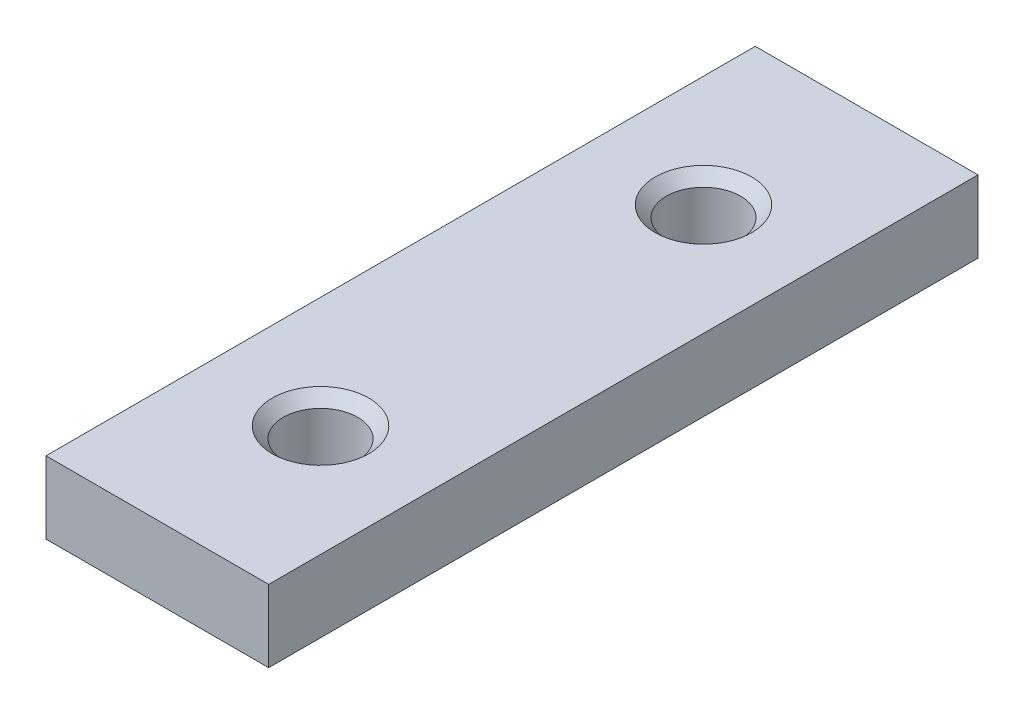
ISO-10303-21;
HEADER;
FILE_DESCRIPTION(('STEP AP214'),'2;1');
FILE_NAME('part.step','',(''),(''),'','','');
FILE_SCHEMA(('AUTOMOTIVE_DESIGN { 1 0 10303 214 1 1 1 1 }'));
ENDSEC;
DATA;
#1=APPLICATION_CONTEXT('core data for automotive mechanical design processes');
#2=APPLICATION_PROTOCOL_DEFINITION('international standard','automotive_design',2000,#1);
#3=PRODUCT_CONTEXT('',#1,'mechanical');
#4=PRODUCT('Part','Part','',(#3));
#5=PRODUCT_RELATED_PRODUCT_CATEGORY('part','',(#4));
#6=PRODUCT_DEFINITION_FORMATION('','',#4);
#7=PRODUCT_DEFINITION_CONTEXT('part definition',#1,'design');
#8=PRODUCT_DEFINITION('design','',#6,#7);
#9=PRODUCT_DEFINITION_SHAPE('','',#8);
#10=(LENGTH_UNIT() NAMED_UNIT(*) SI_UNIT(.MILLI.,.METRE.));
#11=(NAMED_UNIT(*) PLANE_ANGLE_UNIT() SI_UNIT($,.RADIAN.));
#12=(NAMED_UNIT(*) SI_UNIT($,.STERADIAN.) SOLID_ANGLE_UNIT());
#13=UNCERTAINTY_MEASURE_WITH_UNIT(LENGTH_MEASURE(1.E-05),#10,'distance_accuracy_value','');
#14=(GEOMETRIC_REPRESENTATION_CONTEXT(3) GLOBAL_UNCERTAINTY_ASSIGNED_CONTEXT((#13)) GLOBAL_UNIT_ASSIGNED_CONTEXT((#10,
#11,#12)) REPRESENTATION_CONTEXT('',''));
#15=CARTESIAN_POINT('',(0.,0.,0.));
#16=DIRECTION('',(0.,0.,1.));
#17=DIRECTION('',(1.,0.,0.));
#18=AXIS2_PLACEMENT_3D('',#15,#16,#17);
#19=CARTESIAN_POINT('',(-0.55,6.5,0.));
#20=DIRECTION('',(1.,0.,0.));
#21=DIRECTION('',(0.,0.,-1.));
#22=AXIS2_PLACEMENT_3D('',#19,#20,#21);
#23=PLANE('',#22);
#24=DIRECTION('',(0.,0.,1.));
#25=VECTOR('',#24,1.);
#26=CARTESIAN_POINT('',(-0.55,0.,0.));
#27=LINE('',#26,#25);
#28=CARTESIAN_POINT('',(-0.55,0.,0.55));
#29=VERTEX_POINT('',#28);
#30=CARTESIAN_POINT('',(-0.549999999999992,0.,64.45));
#31=VERTEX_POINT('',#30);
#32=EDGE_CURVE('E123',#29,#31,#27,.T.);
#33=ORIENTED_EDGE('',*,*,#32,.F.);
#34=DIRECTION('',(0.,-1.,0.));
#35=VECTOR('',#34,1.);
#36=CARTESIAN_POINT('',(-0.55,6.5,0.55));
#37=LINE('',#36,#35);
#38=CARTESIAN_POINT('',(-0.55,6.5,0.55));
#39=VERTEX_POINT('',#38);
#40=EDGE_CURVE('E91',#39,#29,#37,.T.);
#41=ORIENTED_EDGE('',*,*,#40,.F.);
#42=DIRECTION('',(0.,0.,1.));
#43=VECTOR('',#42,1.);
#44=CARTESIAN_POINT('',(-0.55,6.5,0.));
#45=LINE('',#44,#43);
#46=CARTESIAN_POINT('',(-0.549999999999992,6.5,64.45));
#47=VERTEX_POINT('',#46);
#48=EDGE_CURVE('E102',#39,#47,#45,.T.);
#49=ORIENTED_EDGE('',*,*,#48,.T.);
#50=DIRECTION('',(0.,-1.,0.));
#51=VECTOR('',#50,1.);
#52=CARTESIAN_POINT('',(-0.549999999999992,6.5,64.45));
#53=LINE('',#52,#51);
#54=EDGE_CURVE('E68',#47,#31,#53,.T.);
#55=ORIENTED_EDGE('',*,*,#54,.T.);
#56=EDGE_LOOP('',(#33,#41,#49,#55));
#57=FACE_BOUND('',#56,.T.);
#58=ADVANCED_FACE('F49',(#57),#23,.T.);
#59=CARTESIAN_POINT('',(0.,6.5,0.55));
#60=DIRECTION('',(0.,0.,1.));
#61=DIRECTION('',(1.,0.,0.));
#62=AXIS2_PLACEMENT_3D('',#59,#60,#61);
#63=PLANE('',#62);
#64=DIRECTION('',(-1.,0.,0.));
#65=VECTOR('',#64,1.);
#66=CARTESIAN_POINT('',(0.,0.,0.55));
#67=LINE('',#66,#65);
#68=CARTESIAN_POINT('',(-20.61486665,0.,0.550000000000003));
#69=VERTEX_POINT('',#68);
#70=EDGE_CURVE('E110',#29,#69,#67,.T.);
#71=ORIENTED_EDGE('',*,*,#70,.T.);
#72=DIRECTION('',(0.,-1.,0.));
#73=VECTOR('',#72,1.);
#74=CARTESIAN_POINT('',(-20.61486665,6.5,0.550000000000003));
#75=LINE('',#74,#73);
#76=CARTESIAN_POINT('',(-20.61486665,6.5,0.550000000000003));
#77=VERTEX_POINT('',#76);
#78=EDGE_CURVE('E107',#77,#69,#75,.T.);
#79=ORIENTED_EDGE('',*,*,#78,.F.);
#80=DIRECTION('',(-1.,0.,0.));
#81=VECTOR('',#80,1.);
#82=CARTESIAN_POINT('',(0.,6.5,0.55));
#83=LINE('',#82,#81);
#84=EDGE_CURVE('E96',#39,#77,#83,.T.);
#85=ORIENTED_EDGE('',*,*,#84,.F.);
#86=ORIENTED_EDGE('',*,*,#40,.T.);
#87=EDGE_LOOP('',(#71,#79,#85,#86));
#88=FACE_BOUND('',#87,.T.);
#89=ADVANCED_FACE('F108',(#88),#63,.F.);
#90=CARTESIAN_POINT('',(-20.61486665,6.5,0.));
#91=DIRECTION('',(1.,0.,0.));
#92=DIRECTION('',(0.,0.,-1.));
#93=AXIS2_PLACEMENT_3D('',#90,#91,#92);
#94=PLANE('',#93);
#95=DIRECTION('',(0.,0.,1.));
#96=VECTOR('',#95,1.);
#97=CARTESIAN_POINT('',(-20.61486665,0.,0.));
#98=LINE('',#97,#96);
#99=CARTESIAN_POINT('',(-20.61486665,0.,64.45));
#100=VERTEX_POINT('',#99);
#101=EDGE_CURVE('E128',#69,#100,#98,.T.);
#102=ORIENTED_EDGE('',*,*,#101,.T.);
#103=DIRECTION('',(0.,-1.,0.));
#104=VECTOR('',#103,1.);
#105=CARTESIAN_POINT('',(-20.61486665,6.5,64.45));
#106=LINE('',#105,#104);
#107=CARTESIAN_POINT('',(-20.61486665,6.5,64.45));
#108=VERTEX_POINT('',#107);
#109=EDGE_CURVE('E83',#108,#100,#106,.T.);
#110=ORIENTED_EDGE('',*,*,#109,.F.);
#111=DIRECTION('',(0.,0.,1.));
#112=VECTOR('',#111,1.);
#113=CARTESIAN_POINT('',(-20.61486665,6.5,0.));
#114=LINE('',#113,#112);
#115=EDGE_CURVE('E101',#77,#108,#114,.T.);
#116=ORIENTED_EDGE('',*,*,#115,.F.);
#117=ORIENTED_EDGE('',*,*,#78,.T.);
#118=EDGE_LOOP('',(#102,#110,#116,#117));
#119=FACE_BOUND('',#118,.T.);
#120=ADVANCED_FACE('F115',(#119),#94,.F.);
#121=CARTESIAN_POINT('',(-10.582433325,6.5,15.25));
#122=DIRECTION('',(0.,-1.,0.));
#123=DIRECTION('',(0.,0.,-1.));
#124=AXIS2_PLACEMENT_3D('',#121,#122,#123);
#125=CYLINDRICAL_SURFACE('',#124,3.35);
#126=CARTESIAN_POINT('',(-10.582433325,5.49999999999997,15.25));
#127=DIRECTION('',(0.,1.,0.));
#128=DIRECTION('',(0.,0.,1.));
#129=AXIS2_PLACEMENT_3D('',#126,#127,#128);
#130=CIRCLE('',#129,3.35);
#131=CARTESIAN_POINT('',(-10.582433325,5.49999999999997,18.6));
#132=VERTEX_POINT('',#131);
#133=EDGE_CURVE('E11',#132,#132,#130,.T.);
#134=ORIENTED_EDGE('',*,*,#133,.T.);
#135=EDGE_LOOP('',(#134));
#136=FACE_BOUND('',#135,.T.);
#137=CARTESIAN_POINT('',(-10.582433325,0.,15.25));
#138=DIRECTION('',(0.,1.,0.));
#139=DIRECTION('',(0.,0.,1.));
#140=AXIS2_PLACEMENT_3D('',#137,#138,#139);
#141=CIRCLE('',#140,3.35);
#142=CARTESIAN_POINT('',(-10.582433325,0.,18.6));
#143=VERTEX_POINT('',#142);
#144=EDGE_CURVE('E135',#143,#143,#141,.T.);
#145=ORIENTED_EDGE('',*,*,#144,.F.);
#146=EDGE_LOOP('',(#145));
#147=FACE_BOUND('',#146,.T.);
#148=ADVANCED_FACE('F178',(#136,#147),#125,.F.);
#149=CARTESIAN_POINT('',(0.,6.5,64.45));
#150=DIRECTION('',(0.,0.,1.));
#151=DIRECTION('',(1.,0.,0.));
#152=AXIS2_PLACEMENT_3D('',#149,#150,#151);
#153=PLANE('',#152);
#154=DIRECTION('',(-1.,0.,0.));
#155=VECTOR('',#154,1.);
#156=CARTESIAN_POINT('',(0.,0.,64.45));
#157=LINE('',#156,#155);
#158=EDGE_CURVE('E131',#31,#100,#157,.T.);
#159=ORIENTED_EDGE('',*,*,#158,.F.);
#160=ORIENTED_EDGE('',*,*,#54,.F.);
#161=DIRECTION('',(-1.,0.,0.));
#162=VECTOR('',#161,1.);
#163=CARTESIAN_POINT('',(0.,6.5,64.45));
#164=LINE('',#163,#162);
#165=EDGE_CURVE('E117',#47,#108,#164,.T.);
#166=ORIENTED_EDGE('',*,*,#165,.T.);
#167=ORIENTED_EDGE('',*,*,#109,.T.);
#168=EDGE_LOOP('',(#159,#160,#166,#167));
#169=FACE_BOUND('',#168,.T.);
#170=ADVANCED_FACE('F181',(#169),#153,.T.);
#171=CARTESIAN_POINT('',(-10.582433325,6.5,49.75));
#172=DIRECTION('',(0.,-1.,0.));
#173=DIRECTION('',(0.,0.,-1.));
#174=AXIS2_PLACEMENT_3D('',#171,#172,#173);
#175=CYLINDRICAL_SURFACE('',#174,3.35);
#176=CARTESIAN_POINT('',(-10.582433325,5.50000000000004,49.75));
#177=DIRECTION('',(0.,1.,0.));
#178=DIRECTION('',(0.,0.,1.));
#179=AXIS2_PLACEMENT_3D('',#176,#177,#178);
#180=CIRCLE('',#179,3.35);
#181=CARTESIAN_POINT('',(-10.582433325,5.50000000000004,53.1));
#182=VERTEX_POINT('',#181);
#183=EDGE_CURVE('E60',#182,#182,#180,.T.);
#184=ORIENTED_EDGE('',*,*,#183,.T.);
#185=EDGE_LOOP('',(#184));
#186=FACE_BOUND('',#185,.T.);
#187=CARTESIAN_POINT('',(-10.582433325,0.,49.75));
#188=DIRECTION('',(0.,1.,0.));
#189=DIRECTION('',(0.,0.,1.));
#190=AXIS2_PLACEMENT_3D('',#187,#188,#189);
#191=CIRCLE('',#190,3.35);
#192=CARTESIAN_POINT('',(-10.582433325,0.,53.1));
#193=VERTEX_POINT('',#192);
#194=EDGE_CURVE('E139',#193,#193,#191,.F.);
#195=ORIENTED_EDGE('',*,*,#194,.T.);
#196=EDGE_LOOP('',(#195));
#197=FACE_BOUND('',#196,.T.);
#198=ADVANCED_FACE('F160',(#186,#197),#175,.F.);
#199=CARTESIAN_POINT('',(0.,6.5,0.));
#200=DIRECTION('',(0.,1.,0.));
#201=DIRECTION('',(0.,0.,1.));
#202=AXIS2_PLACEMENT_3D('',#199,#200,#201);
#203=PLANE('',#202);
#204=CARTESIAN_POINT('',(-10.582433325,6.5,49.75));
#205=DIRECTION('',(0.,1.,0.));
#206=DIRECTION('',(0.,0.,1.));
#207=AXIS2_PLACEMENT_3D('',#204,#205,#206);
#208=CIRCLE('',#207,4.34999999999997);
#209=CARTESIAN_POINT('',(-10.582433325,6.5,54.1));
#210=VERTEX_POINT('',#209);
#211=EDGE_CURVE('E153',#210,#210,#208,.F.);
#212=ORIENTED_EDGE('',*,*,#211,.T.);
#213=EDGE_LOOP('',(#212));
#214=FACE_BOUND('',#213,.T.);
#215=CARTESIAN_POINT('',(-10.582433325,6.5,15.25));
#216=DIRECTION('',(0.,1.,0.));
#217=DIRECTION('',(0.,0.,1.));
#218=AXIS2_PLACEMENT_3D('',#215,#216,#217);
#219=CIRCLE('',#218,4.35000000000003);
#220=CARTESIAN_POINT('',(-10.582433325,6.5,19.6));
#221=VERTEX_POINT('',#220);
#222=EDGE_CURVE('E149',#221,#221,#219,.F.);
#223=ORIENTED_EDGE('',*,*,#222,.T.);
#224=EDGE_LOOP('',(#223));
#225=FACE_BOUND('',#224,.T.);
#226=ORIENTED_EDGE('',*,*,#48,.F.);
#227=ORIENTED_EDGE('',*,*,#84,.T.);
#228=ORIENTED_EDGE('',*,*,#115,.T.);
#229=ORIENTED_EDGE('',*,*,#165,.F.);
#230=EDGE_LOOP('',(#226,#227,#228,#229));
#231=FACE_BOUND('',#230,.T.);
#232=ADVANCED_FACE('F98',(#214,#225,#231),#203,.T.);
#233=CARTESIAN_POINT('',(0.,0.,0.));
#234=DIRECTION('',(0.,1.,0.));
#235=DIRECTION('',(0.,0.,1.));
#236=AXIS2_PLACEMENT_3D('',#233,#234,#235);
#237=PLANE('',#236);
#238=ORIENTED_EDGE('',*,*,#32,.T.);
#239=ORIENTED_EDGE('',*,*,#158,.T.);
#240=ORIENTED_EDGE('',*,*,#101,.F.);
#241=ORIENTED_EDGE('',*,*,#70,.F.);
#242=EDGE_LOOP('',(#238,#239,#240,#241));
#243=FACE_BOUND('',#242,.T.);
#244=ORIENTED_EDGE('',*,*,#144,.T.);
#245=EDGE_LOOP('',(#244));
#246=FACE_BOUND('',#245,.T.);
#247=ORIENTED_EDGE('',*,*,#194,.F.);
#248=EDGE_LOOP('',(#247));
#249=FACE_BOUND('',#248,.T.);
#250=ADVANCED_FACE('F166',(#243,#246,#249),#237,.F.);
#251=CARTESIAN_POINT('',(-10.582433325,6.5,49.75));
#252=DIRECTION('',(0.,1.,0.));
#253=DIRECTION('',(0.,0.,1.));
#254=AXIS2_PLACEMENT_3D('',#251,#252,#253);
#255=CONICAL_SURFACE('',#254,4.34999999999997,0.785398163397449);
#256=ORIENTED_EDGE('',*,*,#183,.F.);
#257=EDGE_LOOP('',(#256));
#258=FACE_BOUND('',#257,.T.);
#259=ORIENTED_EDGE('',*,*,#211,.F.);
#260=EDGE_LOOP('',(#259));
#261=FACE_BOUND('',#260,.T.);
#262=ADVANCED_FACE('F163',(#258,#261),#255,.F.);
#263=CARTESIAN_POINT('',(-10.582433325,5.49999999999997,15.25));
#264=DIRECTION('',(0.,1.,0.));
#265=DIRECTION('',(0.,0.,1.));
#266=AXIS2_PLACEMENT_3D('',#263,#264,#265);
#267=CONICAL_SURFACE('',#266,3.35,0.78539816339745);
#268=ORIENTED_EDGE('',*,*,#222,.F.);
#269=EDGE_LOOP('',(#268));
#270=FACE_BOUND('',#269,.T.);
#271=ORIENTED_EDGE('',*,*,#133,.F.);
#272=EDGE_LOOP('',(#271));
#273=FACE_BOUND('',#272,.T.);
#274=ADVANCED_FACE('F52',(#270,#273),#267,.F.);
#275=CLOSED_SHELL('',(#58,#89,#120,#148,#170,#198,#232,#250,#262,#274));
#276=MANIFOLD_SOLID_BREP('B2',#275);
#277=ADVANCED_BREP_SHAPE_REPRESENTATION('',(#18,#276),#14);
#278=SHAPE_DEFINITION_REPRESENTATION(#9,#277);
ENDSEC;
END-ISO-10303-21;
